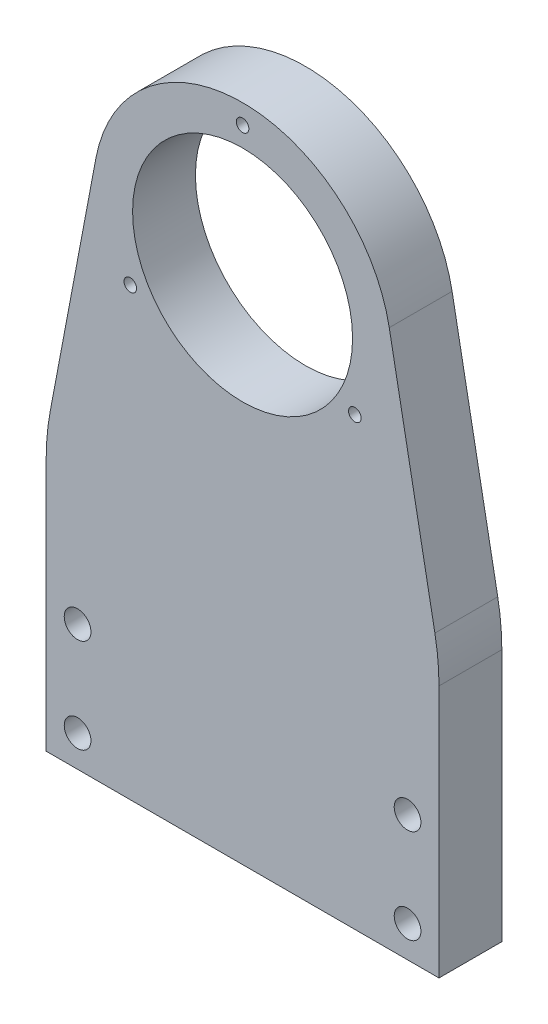
ISO-10303-21;
HEADER;
FILE_DESCRIPTION(('STEP AP214'),'2;1');
FILE_NAME('part.step','',(''),(''),'','','');
FILE_SCHEMA(('AUTOMOTIVE_DESIGN { 1 0 10303 214 1 1 1 1 }'));
ENDSEC;
DATA;
#1=APPLICATION_CONTEXT('core data for automotive mechanical design processes');
#2=APPLICATION_PROTOCOL_DEFINITION('international standard','automotive_design',2000,#1);
#3=PRODUCT_CONTEXT('',#1,'mechanical');
#4=PRODUCT('Part','Part','',(#3));
#5=PRODUCT_RELATED_PRODUCT_CATEGORY('part','',(#4));
#6=PRODUCT_DEFINITION_FORMATION('','',#4);
#7=PRODUCT_DEFINITION_CONTEXT('part definition',#1,'design');
#8=PRODUCT_DEFINITION('design','',#6,#7);
#9=PRODUCT_DEFINITION_SHAPE('','',#8);
#10=(LENGTH_UNIT() NAMED_UNIT(*) SI_UNIT(.MILLI.,.METRE.));
#11=(NAMED_UNIT(*) PLANE_ANGLE_UNIT() SI_UNIT($,.RADIAN.));
#12=(NAMED_UNIT(*) SI_UNIT($,.STERADIAN.) SOLID_ANGLE_UNIT());
#13=UNCERTAINTY_MEASURE_WITH_UNIT(LENGTH_MEASURE(1.E-05),#10,'distance_accuracy_value','');
#14=(GEOMETRIC_REPRESENTATION_CONTEXT(3) GLOBAL_UNCERTAINTY_ASSIGNED_CONTEXT((#13)) GLOBAL_UNIT_ASSIGNED_CONTEXT((#10,
#11,#12)) REPRESENTATION_CONTEXT('',''));
#15=CARTESIAN_POINT('',(0.,0.,0.));
#16=DIRECTION('',(0.,0.,1.));
#17=DIRECTION('',(1.,0.,0.));
#18=AXIS2_PLACEMENT_3D('',#15,#16,#17);
#19=CARTESIAN_POINT('',(0.,0.,0.));
#20=DIRECTION('',(0.,0.,1.));
#21=DIRECTION('',(1.,0.,0.));
#22=AXIS2_PLACEMENT_3D('',#19,#20,#21);
#23=PLANE('',#22);
#24=CARTESIAN_POINT('',(25.,81.5,0.));
#25=DIRECTION('',(0.,0.,-1.));
#26=DIRECTION('',(-1.,0.,0.));
#27=AXIS2_PLACEMENT_3D('',#24,#25,#26);
#28=CIRCLE('',#27,0.799999999999988);
#29=CARTESIAN_POINT('',(24.2,81.5,0.));
#30=VERTEX_POINT('',#29);
#31=EDGE_CURVE('E543',#30,#30,#28,.T.);
#32=ORIENTED_EDGE('',*,*,#31,.F.);
#33=EDGE_LOOP('',(#32));
#34=FACE_BOUND('',#33,.T.);
#35=CARTESIAN_POINT('',(39.2894191624432,56.75,0.));
#36=DIRECTION('',(0.,0.,-1.));
#37=DIRECTION('',(-1.,0.,0.));
#38=AXIS2_PLACEMENT_3D('',#35,#36,#37);
#39=CIRCLE('',#38,0.799999999999988);
#40=CARTESIAN_POINT('',(38.4894191624432,56.75,0.));
#41=VERTEX_POINT('',#40);
#42=EDGE_CURVE('E535',#41,#41,#39,.T.);
#43=ORIENTED_EDGE('',*,*,#42,.F.);
#44=EDGE_LOOP('',(#43));
#45=FACE_BOUND('',#44,.T.);
#46=CARTESIAN_POINT('',(10.7105808375568,56.75,0.));
#47=DIRECTION('',(0.,0.,-1.));
#48=DIRECTION('',(-1.,0.,0.));
#49=AXIS2_PLACEMENT_3D('',#46,#47,#48);
#50=CIRCLE('',#49,0.799999999999988);
#51=CARTESIAN_POINT('',(9.91058083755677,56.75,0.));
#52=VERTEX_POINT('',#51);
#53=EDGE_CURVE('E530',#52,#52,#50,.T.);
#54=ORIENTED_EDGE('',*,*,#53,.F.);
#55=EDGE_LOOP('',(#54));
#56=FACE_BOUND('',#55,.T.);
#57=CARTESIAN_POINT('',(46.,16.,0.));
#58=DIRECTION('',(0.,0.,-1.));
#59=DIRECTION('',(-1.,0.,0.));
#60=AXIS2_PLACEMENT_3D('',#57,#58,#59);
#61=CIRCLE('',#60,3.36);
#62=CARTESIAN_POINT('',(42.64,16.,0.));
#63=VERTEX_POINT('',#62);
#64=EDGE_CURVE('E162',#63,#63,#61,.T.);
#65=ORIENTED_EDGE('',*,*,#64,.F.);
#66=EDGE_LOOP('',(#65));
#67=FACE_BOUND('',#66,.T.);
#68=CARTESIAN_POINT('',(25.,65.,0.));
#69=DIRECTION('',(0.,0.,-1.));
#70=DIRECTION('',(-1.,0.,0.));
#71=AXIS2_PLACEMENT_3D('',#68,#69,#70);
#72=CIRCLE('',#71,14.);
#73=CARTESIAN_POINT('',(11.,65.,0.));
#74=VERTEX_POINT('',#73);
#75=EDGE_CURVE('E181',#74,#74,#72,.T.);
#76=ORIENTED_EDGE('',*,*,#75,.F.);
#77=EDGE_LOOP('',(#76));
#78=FACE_BOUND('',#77,.T.);
#79=DIRECTION('',(0.,1.,0.));
#80=VECTOR('',#79,1.);
#81=CARTESIAN_POINT('',(0.,0.,0.));
#82=LINE('',#81,#80);
#83=CARTESIAN_POINT('',(0.,0.,0.));
#84=VERTEX_POINT('',#83);
#85=CARTESIAN_POINT('',(0.,32.1926516692291,0.));
#86=VERTEX_POINT('',#85);
#87=EDGE_CURVE('E209',#84,#86,#82,.T.);
#88=ORIENTED_EDGE('',*,*,#87,.T.);
#89=CARTESIAN_POINT('',(30.,32.1926516692291,0.));
#90=DIRECTION('',(0.,0.,1.));
#91=DIRECTION('',(1.,0.,0.));
#92=AXIS2_PLACEMENT_3D('',#89,#90,#91);
#93=CIRCLE('',#92,30.);
#94=CARTESIAN_POINT('',(0.520852592381924,37.7586078422442,0.));
#95=VERTEX_POINT('',#94);
#96=EDGE_CURVE('E230',#86,#95,#93,.F.);
#97=ORIENTED_EDGE('',*,*,#96,.T.);
#98=DIRECTION('',(0.185531872433835,0.982638246920603,0.));
#99=VECTOR('',#98,1.);
#100=CARTESIAN_POINT('',(-6.38087498566983,1.20477264910817,0.));
#101=LINE('',#100,#99);
#102=CARTESIAN_POINT('',(6.32987330850855,68.5251055762429,0.));
#103=VERTEX_POINT('',#102);
#104=EDGE_CURVE('E207',#95,#103,#101,.T.);
#105=ORIENTED_EDGE('',*,*,#104,.T.);
#106=CARTESIAN_POINT('',(25.,65.,0.));
#107=DIRECTION('',(0.,0.,1.));
#108=DIRECTION('',(1.,0.,0.));
#109=AXIS2_PLACEMENT_3D('',#106,#107,#108);
#110=CIRCLE('',#109,19.);
#111=CARTESIAN_POINT('',(43.6701266914915,68.5251055762429,0.));
#112=VERTEX_POINT('',#111);
#113=EDGE_CURVE('E204',#112,#103,#110,.T.);
#114=ORIENTED_EDGE('',*,*,#113,.F.);
#115=DIRECTION('',(-0.185531872433835,0.982638246920603,0.));
#116=VECTOR('',#115,1.);
#117=CARTESIAN_POINT('',(54.6597712012296,10.3203083429222,0.));
#118=LINE('',#117,#116);
#119=CARTESIAN_POINT('',(49.4791474076181,37.7586078422442,0.));
#120=VERTEX_POINT('',#119);
#121=EDGE_CURVE('E184',#120,#112,#118,.T.);
#122=ORIENTED_EDGE('',*,*,#121,.F.);
#123=CARTESIAN_POINT('',(20.,32.1926516692291,0.));
#124=DIRECTION('',(0.,0.,1.));
#125=DIRECTION('',(1.,0.,0.));
#126=AXIS2_PLACEMENT_3D('',#123,#124,#125);
#127=CIRCLE('',#126,30.);
#128=CARTESIAN_POINT('',(50.,32.1926516692291,0.));
#129=VERTEX_POINT('',#128);
#130=EDGE_CURVE('E228',#120,#129,#127,.F.);
#131=ORIENTED_EDGE('',*,*,#130,.T.);
#132=DIRECTION('',(0.,1.,0.));
#133=VECTOR('',#132,1.);
#134=CARTESIAN_POINT('',(50.,0.,0.));
#135=LINE('',#134,#133);
#136=CARTESIAN_POINT('',(50.,0.,0.));
#137=VERTEX_POINT('',#136);
#138=EDGE_CURVE('E190',#137,#129,#135,.T.);
#139=ORIENTED_EDGE('',*,*,#138,.F.);
#140=DIRECTION('',(1.,0.,0.));
#141=VECTOR('',#140,1.);
#142=CARTESIAN_POINT('',(0.,0.,0.));
#143=LINE('',#142,#141);
#144=EDGE_CURVE('E212',#84,#137,#143,.T.);
#145=ORIENTED_EDGE('',*,*,#144,.F.);
#146=EDGE_LOOP('',(#88,#97,#105,#114,#122,#131,#139,#145));
#147=FACE_BOUND('',#146,.T.);
#148=CARTESIAN_POINT('',(46.,4.,0.));
#149=DIRECTION('',(0.,0.,-1.));
#150=DIRECTION('',(-1.,0.,0.));
#151=AXIS2_PLACEMENT_3D('',#148,#149,#150);
#152=CIRCLE('',#151,3.36);
#153=CARTESIAN_POINT('',(42.64,4.,0.));
#154=VERTEX_POINT('',#153);
#155=EDGE_CURVE('E171',#154,#154,#152,.T.);
#156=ORIENTED_EDGE('',*,*,#155,.F.);
#157=EDGE_LOOP('',(#156));
#158=FACE_BOUND('',#157,.T.);
#159=CARTESIAN_POINT('',(4.,4.,0.));
#160=DIRECTION('',(0.,0.,-1.));
#161=DIRECTION('',(-1.,0.,0.));
#162=AXIS2_PLACEMENT_3D('',#159,#160,#161);
#163=CIRCLE('',#162,3.36);
#164=CARTESIAN_POINT('',(0.639999999999998,4.,0.));
#165=VERTEX_POINT('',#164);
#166=EDGE_CURVE('E153',#165,#165,#163,.T.);
#167=ORIENTED_EDGE('',*,*,#166,.F.);
#168=EDGE_LOOP('',(#167));
#169=FACE_BOUND('',#168,.T.);
#170=CARTESIAN_POINT('',(4.,16.,0.));
#171=DIRECTION('',(0.,0.,-1.));
#172=DIRECTION('',(-1.,0.,0.));
#173=AXIS2_PLACEMENT_3D('',#170,#171,#172);
#174=CIRCLE('',#173,3.36);
#175=CARTESIAN_POINT('',(0.639999999999999,16.,0.));
#176=VERTEX_POINT('',#175);
#177=EDGE_CURVE('E144',#176,#176,#174,.T.);
#178=ORIENTED_EDGE('',*,*,#177,.F.);
#179=EDGE_LOOP('',(#178));
#180=FACE_BOUND('',#179,.T.);
#181=ADVANCED_FACE('F52',(#34,#45,#56,#67,#78,#147,#158,#169,#180),#23,.F.);
#182=CARTESIAN_POINT('',(54.6597712012296,10.3203083429222,8.));
#183=DIRECTION('',(-0.982638246920603,-0.185531872433835,0.));
#184=DIRECTION('',(0.185531872433835,-0.982638246920603,0.));
#185=AXIS2_PLACEMENT_3D('',#182,#183,#184);
#186=PLANE('',#185);
#187=DIRECTION('',(-0.185531872433835,0.982638246920603,0.));
#188=VECTOR('',#187,1.);
#189=CARTESIAN_POINT('',(54.6597712012296,10.3203083429222,8.));
#190=LINE('',#189,#188);
#191=CARTESIAN_POINT('',(49.4791474076181,37.7586078422442,8.));
#192=VERTEX_POINT('',#191);
#193=CARTESIAN_POINT('',(43.6701266914915,68.5251055762429,8.));
#194=VERTEX_POINT('',#193);
#195=EDGE_CURVE('E187',#192,#194,#190,.T.);
#196=ORIENTED_EDGE('',*,*,#195,.F.);
#197=DIRECTION('',(0.,0.,-1.));
#198=VECTOR('',#197,1.);
#199=CARTESIAN_POINT('',(49.4791474076181,37.7586078422442,8.));
#200=LINE('',#199,#198);
#201=EDGE_CURVE('E60',#192,#120,#200,.T.);
#202=ORIENTED_EDGE('',*,*,#201,.T.);
#203=ORIENTED_EDGE('',*,*,#121,.T.);
#204=DIRECTION('',(0.,0.,-1.));
#205=VECTOR('',#204,1.);
#206=CARTESIAN_POINT('',(43.6701266914915,68.5251055762429,8.));
#207=LINE('',#206,#205);
#208=EDGE_CURVE('E222',#194,#112,#207,.T.);
#209=ORIENTED_EDGE('',*,*,#208,.F.);
#210=EDGE_LOOP('',(#196,#202,#203,#209));
#211=FACE_BOUND('',#210,.T.);
#212=ADVANCED_FACE('F240',(#211),#186,.F.);
#213=CARTESIAN_POINT('',(25.,65.,8.));
#214=DIRECTION('',(0.,0.,-1.));
#215=DIRECTION('',(-1.,0.,0.));
#216=AXIS2_PLACEMENT_3D('',#213,#214,#215);
#217=CYLINDRICAL_SURFACE('',#216,19.);
#218=ORIENTED_EDGE('',*,*,#113,.T.);
#219=DIRECTION('',(0.,0.,-1.));
#220=VECTOR('',#219,1.);
#221=CARTESIAN_POINT('',(6.32987330850855,68.5251055762429,8.));
#222=LINE('',#221,#220);
#223=CARTESIAN_POINT('',(6.32987330850855,68.5251055762429,8.));
#224=VERTEX_POINT('',#223);
#225=EDGE_CURVE('E219',#224,#103,#222,.T.);
#226=ORIENTED_EDGE('',*,*,#225,.F.);
#227=CARTESIAN_POINT('',(25.,65.,8.));
#228=DIRECTION('',(0.,0.,1.));
#229=DIRECTION('',(1.,0.,0.));
#230=AXIS2_PLACEMENT_3D('',#227,#228,#229);
#231=CIRCLE('',#230,19.);
#232=EDGE_CURVE('E189',#194,#224,#231,.T.);
#233=ORIENTED_EDGE('',*,*,#232,.F.);
#234=ORIENTED_EDGE('',*,*,#208,.T.);
#235=EDGE_LOOP('',(#218,#226,#233,#234));
#236=FACE_BOUND('',#235,.T.);
#237=ADVANCED_FACE('F251',(#236),#217,.T.);
#238=CARTESIAN_POINT('',(-6.38087498566983,1.20477264910817,8.));
#239=DIRECTION('',(-0.982638246920603,0.185531872433835,0.));
#240=DIRECTION('',(-0.185531872433835,-0.982638246920603,0.));
#241=AXIS2_PLACEMENT_3D('',#238,#239,#240);
#242=PLANE('',#241);
#243=ORIENTED_EDGE('',*,*,#104,.F.);
#244=DIRECTION('',(0.,0.,-1.));
#245=VECTOR('',#244,1.);
#246=CARTESIAN_POINT('',(0.520852592381923,37.7586078422442,8.));
#247=LINE('',#246,#245);
#248=CARTESIAN_POINT('',(0.520852592381924,37.7586078422442,8.));
#249=VERTEX_POINT('',#248);
#250=EDGE_CURVE('E232',#95,#249,#247,.F.);
#251=ORIENTED_EDGE('',*,*,#250,.T.);
#252=DIRECTION('',(0.185531872433835,0.982638246920603,0.));
#253=VECTOR('',#252,1.);
#254=CARTESIAN_POINT('',(-6.38087498566983,1.20477264910817,8.));
#255=LINE('',#254,#253);
#256=EDGE_CURVE('E193',#249,#224,#255,.T.);
#257=ORIENTED_EDGE('',*,*,#256,.T.);
#258=ORIENTED_EDGE('',*,*,#225,.T.);
#259=EDGE_LOOP('',(#243,#251,#257,#258));
#260=FACE_BOUND('',#259,.T.);
#261=ADVANCED_FACE('F297',(#260),#242,.T.);
#262=CARTESIAN_POINT('',(0.,0.,8.));
#263=DIRECTION('',(-1.,0.,0.));
#264=DIRECTION('',(0.,0.,1.));
#265=AXIS2_PLACEMENT_3D('',#262,#263,#264);
#266=PLANE('',#265);
#267=DIRECTION('',(0.,1.,0.));
#268=VECTOR('',#267,1.);
#269=CARTESIAN_POINT('',(0.,0.,8.));
#270=LINE('',#269,#268);
#271=CARTESIAN_POINT('',(0.,0.,8.));
#272=VERTEX_POINT('',#271);
#273=CARTESIAN_POINT('',(0.,32.1926516692291,8.));
#274=VERTEX_POINT('',#273);
#275=EDGE_CURVE('E195',#272,#274,#270,.T.);
#276=ORIENTED_EDGE('',*,*,#275,.T.);
#277=DIRECTION('',(0.,0.,-1.));
#278=VECTOR('',#277,1.);
#279=CARTESIAN_POINT('',(0.,32.1926516692291,8.));
#280=LINE('',#279,#278);
#281=EDGE_CURVE('E225',#274,#86,#280,.T.);
#282=ORIENTED_EDGE('',*,*,#281,.T.);
#283=ORIENTED_EDGE('',*,*,#87,.F.);
#284=DIRECTION('',(0.,0.,-1.));
#285=VECTOR('',#284,1.);
#286=CARTESIAN_POINT('',(0.,0.,8.));
#287=LINE('',#286,#285);
#288=EDGE_CURVE('E217',#272,#84,#287,.T.);
#289=ORIENTED_EDGE('',*,*,#288,.F.);
#290=EDGE_LOOP('',(#276,#282,#283,#289));
#291=FACE_BOUND('',#290,.T.);
#292=ADVANCED_FACE('F263',(#291),#266,.T.);
#293=CARTESIAN_POINT('',(0.,0.,8.));
#294=DIRECTION('',(0.,1.,0.));
#295=DIRECTION('',(0.,0.,1.));
#296=AXIS2_PLACEMENT_3D('',#293,#294,#295);
#297=PLANE('',#296);
#298=CARTESIAN_POINT('',(38.,0.,4.));
#299=DIRECTION('',(0.,-1.,0.));
#300=DIRECTION('',(0.,0.,-1.));
#301=AXIS2_PLACEMENT_3D('',#298,#299,#300);
#302=CIRCLE('',#301,1.24999999999999);
#303=CARTESIAN_POINT('',(38.,0.,2.75000000000001));
#304=VERTEX_POINT('',#303);
#305=EDGE_CURVE('E132',#304,#304,#302,.T.);
#306=ORIENTED_EDGE('',*,*,#305,.F.);
#307=EDGE_LOOP('',(#306));
#308=FACE_BOUND('',#307,.T.);
#309=CARTESIAN_POINT('',(12.,0.,4.));
#310=DIRECTION('',(0.,-1.,0.));
#311=DIRECTION('',(0.,0.,-1.));
#312=AXIS2_PLACEMENT_3D('',#309,#310,#311);
#313=CIRCLE('',#312,1.24999999999999);
#314=CARTESIAN_POINT('',(12.,0.,2.75000000000001));
#315=VERTEX_POINT('',#314);
#316=EDGE_CURVE('E131',#315,#315,#313,.T.);
#317=ORIENTED_EDGE('',*,*,#316,.F.);
#318=EDGE_LOOP('',(#317));
#319=FACE_BOUND('',#318,.T.);
#320=ORIENTED_EDGE('',*,*,#144,.T.);
#321=DIRECTION('',(0.,0.,-1.));
#322=VECTOR('',#321,1.);
#323=CARTESIAN_POINT('',(50.,0.,8.));
#324=LINE('',#323,#322);
#325=CARTESIAN_POINT('',(50.,0.,8.));
#326=VERTEX_POINT('',#325);
#327=EDGE_CURVE('E202',#326,#137,#324,.T.);
#328=ORIENTED_EDGE('',*,*,#327,.F.);
#329=DIRECTION('',(1.,0.,0.));
#330=VECTOR('',#329,1.);
#331=CARTESIAN_POINT('',(0.,0.,8.));
#332=LINE('',#331,#330);
#333=EDGE_CURVE('E198',#272,#326,#332,.T.);
#334=ORIENTED_EDGE('',*,*,#333,.F.);
#335=ORIENTED_EDGE('',*,*,#288,.T.);
#336=EDGE_LOOP('',(#320,#328,#334,#335));
#337=FACE_BOUND('',#336,.T.);
#338=ADVANCED_FACE('F267',(#308,#319,#337),#297,.F.);
#339=CARTESIAN_POINT('',(50.,0.,8.));
#340=DIRECTION('',(-1.,0.,0.));
#341=DIRECTION('',(0.,0.,1.));
#342=AXIS2_PLACEMENT_3D('',#339,#340,#341);
#343=PLANE('',#342);
#344=ORIENTED_EDGE('',*,*,#138,.T.);
#345=DIRECTION('',(0.,0.,-1.));
#346=VECTOR('',#345,1.);
#347=CARTESIAN_POINT('',(50.,32.1926516692291,8.));
#348=LINE('',#347,#346);
#349=CARTESIAN_POINT('',(50.,32.1926516692291,8.));
#350=VERTEX_POINT('',#349);
#351=EDGE_CURVE('E13',#129,#350,#348,.F.);
#352=ORIENTED_EDGE('',*,*,#351,.T.);
#353=DIRECTION('',(0.,1.,0.));
#354=VECTOR('',#353,1.);
#355=CARTESIAN_POINT('',(50.,0.,8.));
#356=LINE('',#355,#354);
#357=EDGE_CURVE('E200',#326,#350,#356,.T.);
#358=ORIENTED_EDGE('',*,*,#357,.F.);
#359=ORIENTED_EDGE('',*,*,#327,.T.);
#360=EDGE_LOOP('',(#344,#352,#358,#359));
#361=FACE_BOUND('',#360,.T.);
#362=ADVANCED_FACE('F269',(#361),#343,.F.);
#363=CARTESIAN_POINT('',(0.,0.,8.));
#364=DIRECTION('',(0.,0.,1.));
#365=DIRECTION('',(1.,0.,0.));
#366=AXIS2_PLACEMENT_3D('',#363,#364,#365);
#367=PLANE('',#366);
#368=CARTESIAN_POINT('',(25.,81.5,8.));
#369=DIRECTION('',(0.,0.,-1.));
#370=DIRECTION('',(-1.,0.,0.));
#371=AXIS2_PLACEMENT_3D('',#368,#369,#370);
#372=CIRCLE('',#371,0.799999999999999);
#373=CARTESIAN_POINT('',(24.2,81.5,8.));
#374=VERTEX_POINT('',#373);
#375=EDGE_CURVE('E540',#374,#374,#372,.T.);
#376=ORIENTED_EDGE('',*,*,#375,.T.);
#377=EDGE_LOOP('',(#376));
#378=FACE_BOUND('',#377,.T.);
#379=CARTESIAN_POINT('',(39.2894191624432,56.75,8.));
#380=DIRECTION('',(0.,0.,-1.));
#381=DIRECTION('',(-1.,0.,0.));
#382=AXIS2_PLACEMENT_3D('',#379,#380,#381);
#383=CIRCLE('',#382,0.799999999999995);
#384=CARTESIAN_POINT('',(38.4894191624432,56.75,8.));
#385=VERTEX_POINT('',#384);
#386=EDGE_CURVE('E532',#385,#385,#383,.T.);
#387=ORIENTED_EDGE('',*,*,#386,.T.);
#388=EDGE_LOOP('',(#387));
#389=FACE_BOUND('',#388,.T.);
#390=CARTESIAN_POINT('',(10.7105808375568,56.75,8.));
#391=DIRECTION('',(0.,0.,-1.));
#392=DIRECTION('',(-1.,0.,0.));
#393=AXIS2_PLACEMENT_3D('',#390,#391,#392);
#394=CIRCLE('',#393,0.799999999999999);
#395=CARTESIAN_POINT('',(9.91058083755676,56.75,8.));
#396=VERTEX_POINT('',#395);
#397=EDGE_CURVE('E138',#396,#396,#394,.T.);
#398=ORIENTED_EDGE('',*,*,#397,.T.);
#399=EDGE_LOOP('',(#398));
#400=FACE_BOUND('',#399,.T.);
#401=CARTESIAN_POINT('',(4.,16.,8.));
#402=DIRECTION('',(0.,0.,1.));
#403=DIRECTION('',(1.,0.,0.));
#404=AXIS2_PLACEMENT_3D('',#401,#402,#403);
#405=CIRCLE('',#404,1.7);
#406=CARTESIAN_POINT('',(5.7,16.,8.));
#407=VERTEX_POINT('',#406);
#408=EDGE_CURVE('E150',#407,#407,#405,.T.);
#409=ORIENTED_EDGE('',*,*,#408,.F.);
#410=EDGE_LOOP('',(#409));
#411=FACE_BOUND('',#410,.T.);
#412=CARTESIAN_POINT('',(4.,4.,8.));
#413=DIRECTION('',(0.,0.,1.));
#414=DIRECTION('',(1.,0.,0.));
#415=AXIS2_PLACEMENT_3D('',#412,#413,#414);
#416=CIRCLE('',#415,1.7);
#417=CARTESIAN_POINT('',(5.7,4.,8.));
#418=VERTEX_POINT('',#417);
#419=EDGE_CURVE('E159',#418,#418,#416,.T.);
#420=ORIENTED_EDGE('',*,*,#419,.F.);
#421=EDGE_LOOP('',(#420));
#422=FACE_BOUND('',#421,.T.);
#423=CARTESIAN_POINT('',(46.,16.,8.));
#424=DIRECTION('',(0.,0.,1.));
#425=DIRECTION('',(1.,0.,0.));
#426=AXIS2_PLACEMENT_3D('',#423,#424,#425);
#427=CIRCLE('',#426,1.7);
#428=CARTESIAN_POINT('',(47.7,16.,8.));
#429=VERTEX_POINT('',#428);
#430=EDGE_CURVE('E168',#429,#429,#427,.T.);
#431=ORIENTED_EDGE('',*,*,#430,.F.);
#432=EDGE_LOOP('',(#431));
#433=FACE_BOUND('',#432,.T.);
#434=CARTESIAN_POINT('',(46.,4.,8.));
#435=DIRECTION('',(0.,0.,1.));
#436=DIRECTION('',(1.,0.,0.));
#437=AXIS2_PLACEMENT_3D('',#434,#435,#436);
#438=CIRCLE('',#437,1.7);
#439=CARTESIAN_POINT('',(47.7,4.,8.));
#440=VERTEX_POINT('',#439);
#441=EDGE_CURVE('E177',#440,#440,#438,.T.);
#442=ORIENTED_EDGE('',*,*,#441,.F.);
#443=EDGE_LOOP('',(#442));
#444=FACE_BOUND('',#443,.T.);
#445=CARTESIAN_POINT('',(25.,65.,8.));
#446=DIRECTION('',(0.,0.,1.));
#447=DIRECTION('',(1.,0.,0.));
#448=AXIS2_PLACEMENT_3D('',#445,#446,#447);
#449=CIRCLE('',#448,14.);
#450=CARTESIAN_POINT('',(39.,65.,8.));
#451=VERTEX_POINT('',#450);
#452=EDGE_CURVE('E180',#451,#451,#449,.F.);
#453=ORIENTED_EDGE('',*,*,#452,.T.);
#454=EDGE_LOOP('',(#453));
#455=FACE_BOUND('',#454,.T.);
#456=ORIENTED_EDGE('',*,*,#256,.F.);
#457=CARTESIAN_POINT('',(30.,32.1926516692291,8.));
#458=DIRECTION('',(0.,0.,1.));
#459=DIRECTION('',(1.,0.,0.));
#460=AXIS2_PLACEMENT_3D('',#457,#458,#459);
#461=CIRCLE('',#460,30.);
#462=EDGE_CURVE('E235',#249,#274,#461,.T.);
#463=ORIENTED_EDGE('',*,*,#462,.T.);
#464=ORIENTED_EDGE('',*,*,#275,.F.);
#465=ORIENTED_EDGE('',*,*,#333,.T.);
#466=ORIENTED_EDGE('',*,*,#357,.T.);
#467=CARTESIAN_POINT('',(20.,32.1926516692291,8.));
#468=DIRECTION('',(0.,0.,1.));
#469=DIRECTION('',(1.,0.,0.));
#470=AXIS2_PLACEMENT_3D('',#467,#468,#469);
#471=CIRCLE('',#470,30.);
#472=EDGE_CURVE('E72',#350,#192,#471,.T.);
#473=ORIENTED_EDGE('',*,*,#472,.T.);
#474=ORIENTED_EDGE('',*,*,#195,.T.);
#475=ORIENTED_EDGE('',*,*,#232,.T.);
#476=EDGE_LOOP('',(#456,#463,#464,#465,#466,#473,#474,#475));
#477=FACE_BOUND('',#476,.T.);
#478=ADVANCED_FACE('F253',(#378,#389,#400,#411,#422,#433,#444,#455,#477),#367,.T.);
#479=CARTESIAN_POINT('',(30.,32.1926516692291,8.));
#480=DIRECTION('',(0.,0.,-1.));
#481=DIRECTION('',(-1.,0.,0.));
#482=AXIS2_PLACEMENT_3D('',#479,#480,#481);
#483=CYLINDRICAL_SURFACE('',#482,30.);
#484=ORIENTED_EDGE('',*,*,#462,.F.);
#485=ORIENTED_EDGE('',*,*,#250,.F.);
#486=ORIENTED_EDGE('',*,*,#96,.F.);
#487=ORIENTED_EDGE('',*,*,#281,.F.);
#488=EDGE_LOOP('',(#484,#485,#486,#487));
#489=FACE_BOUND('',#488,.T.);
#490=ADVANCED_FACE('F260',(#489),#483,.T.);
#491=CARTESIAN_POINT('',(20.,32.1926516692291,8.));
#492=DIRECTION('',(0.,0.,-1.));
#493=DIRECTION('',(-1.,0.,0.));
#494=AXIS2_PLACEMENT_3D('',#491,#492,#493);
#495=CYLINDRICAL_SURFACE('',#494,30.);
#496=ORIENTED_EDGE('',*,*,#472,.F.);
#497=ORIENTED_EDGE('',*,*,#351,.F.);
#498=ORIENTED_EDGE('',*,*,#130,.F.);
#499=ORIENTED_EDGE('',*,*,#201,.F.);
#500=EDGE_LOOP('',(#496,#497,#498,#499));
#501=FACE_BOUND('',#500,.T.);
#502=ADVANCED_FACE('F54',(#501),#495,.T.);
#503=CARTESIAN_POINT('',(25.,65.,8.001));
#504=DIRECTION('',(0.,0.,-1.));
#505=DIRECTION('',(-1.,0.,0.));
#506=AXIS2_PLACEMENT_3D('',#503,#504,#505);
#507=CYLINDRICAL_SURFACE('',#506,14.);
#508=ORIENTED_EDGE('',*,*,#452,.F.);
#509=EDGE_LOOP('',(#508));
#510=FACE_BOUND('',#509,.T.);
#511=ORIENTED_EDGE('',*,*,#75,.T.);
#512=EDGE_LOOP('',(#511));
#513=FACE_BOUND('',#512,.T.);
#514=ADVANCED_FACE('F271',(#510,#513),#507,.F.);
#515=CARTESIAN_POINT('',(46.,4.,0.));
#516=DIRECTION('',(0.,0.,-1.));
#517=DIRECTION('',(-1.,0.,0.));
#518=AXIS2_PLACEMENT_3D('',#515,#516,#517);
#519=CYLINDRICAL_SURFACE('',#518,1.7);
#520=CARTESIAN_POINT('',(46.,4.,1.66));
#521=DIRECTION('',(0.,0.,-1.));
#522=DIRECTION('',(-1.,0.,0.));
#523=AXIS2_PLACEMENT_3D('',#520,#521,#522);
#524=CIRCLE('',#523,1.7);
#525=CARTESIAN_POINT('',(44.3,4.,1.66));
#526=VERTEX_POINT('',#525);
#527=EDGE_CURVE('E174',#526,#526,#524,.T.);
#528=ORIENTED_EDGE('',*,*,#527,.T.);
#529=EDGE_LOOP('',(#528));
#530=FACE_BOUND('',#529,.T.);
#531=ORIENTED_EDGE('',*,*,#441,.T.);
#532=EDGE_LOOP('',(#531));
#533=FACE_BOUND('',#532,.T.);
#534=ADVANCED_FACE('F276',(#530,#533),#519,.F.);
#535=CARTESIAN_POINT('',(46.,4.,0.));
#536=DIRECTION('',(0.,0.,-1.));
#537=DIRECTION('',(-1.,0.,0.));
#538=AXIS2_PLACEMENT_3D('',#535,#536,#537);
#539=CONICAL_SURFACE('',#538,3.36,0.785398163397449);
#540=ORIENTED_EDGE('',*,*,#527,.F.);
#541=EDGE_LOOP('',(#540));
#542=FACE_BOUND('',#541,.T.);
#543=ORIENTED_EDGE('',*,*,#155,.T.);
#544=EDGE_LOOP('',(#543));
#545=FACE_BOUND('',#544,.T.);
#546=ADVANCED_FACE('F354',(#542,#545),#539,.F.);
#547=CARTESIAN_POINT('',(46.,16.,0.));
#548=DIRECTION('',(0.,0.,-1.));
#549=DIRECTION('',(-1.,0.,0.));
#550=AXIS2_PLACEMENT_3D('',#547,#548,#549);
#551=CYLINDRICAL_SURFACE('',#550,1.7);
#552=CARTESIAN_POINT('',(46.,16.,1.66));
#553=DIRECTION('',(0.,0.,-1.));
#554=DIRECTION('',(-1.,0.,0.));
#555=AXIS2_PLACEMENT_3D('',#552,#553,#554);
#556=CIRCLE('',#555,1.7);
#557=CARTESIAN_POINT('',(44.3,16.,1.66));
#558=VERTEX_POINT('',#557);
#559=EDGE_CURVE('E165',#558,#558,#556,.T.);
#560=ORIENTED_EDGE('',*,*,#559,.T.);
#561=EDGE_LOOP('',(#560));
#562=FACE_BOUND('',#561,.T.);
#563=ORIENTED_EDGE('',*,*,#430,.T.);
#564=EDGE_LOOP('',(#563));
#565=FACE_BOUND('',#564,.T.);
#566=ADVANCED_FACE('F365',(#562,#565),#551,.F.);
#567=CARTESIAN_POINT('',(46.,16.,0.));
#568=DIRECTION('',(0.,0.,-1.));
#569=DIRECTION('',(-1.,0.,0.));
#570=AXIS2_PLACEMENT_3D('',#567,#568,#569);
#571=CONICAL_SURFACE('',#570,3.36,0.785398163397449);
#572=ORIENTED_EDGE('',*,*,#559,.F.);
#573=EDGE_LOOP('',(#572));
#574=FACE_BOUND('',#573,.T.);
#575=ORIENTED_EDGE('',*,*,#64,.T.);
#576=EDGE_LOOP('',(#575));
#577=FACE_BOUND('',#576,.T.);
#578=ADVANCED_FACE('F375',(#574,#577),#571,.F.);
#579=CARTESIAN_POINT('',(4.,4.,0.));
#580=DIRECTION('',(0.,0.,-1.));
#581=DIRECTION('',(-1.,0.,0.));
#582=AXIS2_PLACEMENT_3D('',#579,#580,#581);
#583=CYLINDRICAL_SURFACE('',#582,1.7);
#584=CARTESIAN_POINT('',(4.,4.,1.66));
#585=DIRECTION('',(0.,0.,-1.));
#586=DIRECTION('',(-1.,0.,0.));
#587=AXIS2_PLACEMENT_3D('',#584,#585,#586);
#588=CIRCLE('',#587,1.7);
#589=CARTESIAN_POINT('',(2.3,4.,1.66));
#590=VERTEX_POINT('',#589);
#591=EDGE_CURVE('E156',#590,#590,#588,.T.);
#592=ORIENTED_EDGE('',*,*,#591,.T.);
#593=EDGE_LOOP('',(#592));
#594=FACE_BOUND('',#593,.T.);
#595=ORIENTED_EDGE('',*,*,#419,.T.);
#596=EDGE_LOOP('',(#595));
#597=FACE_BOUND('',#596,.T.);
#598=ADVANCED_FACE('F385',(#594,#597),#583,.F.);
#599=CARTESIAN_POINT('',(4.,4.,0.));
#600=DIRECTION('',(0.,0.,-1.));
#601=DIRECTION('',(-1.,0.,0.));
#602=AXIS2_PLACEMENT_3D('',#599,#600,#601);
#603=CONICAL_SURFACE('',#602,3.36,0.785398163397449);
#604=ORIENTED_EDGE('',*,*,#591,.F.);
#605=EDGE_LOOP('',(#604));
#606=FACE_BOUND('',#605,.T.);
#607=ORIENTED_EDGE('',*,*,#166,.T.);
#608=EDGE_LOOP('',(#607));
#609=FACE_BOUND('',#608,.T.);
#610=ADVANCED_FACE('F395',(#606,#609),#603,.F.);
#611=CARTESIAN_POINT('',(4.,16.,0.));
#612=DIRECTION('',(0.,0.,-1.));
#613=DIRECTION('',(-1.,0.,0.));
#614=AXIS2_PLACEMENT_3D('',#611,#612,#613);
#615=CYLINDRICAL_SURFACE('',#614,1.7);
#616=CARTESIAN_POINT('',(4.,16.,1.66));
#617=DIRECTION('',(0.,0.,-1.));
#618=DIRECTION('',(-1.,0.,0.));
#619=AXIS2_PLACEMENT_3D('',#616,#617,#618);
#620=CIRCLE('',#619,1.7);
#621=CARTESIAN_POINT('',(2.3,16.,1.66));
#622=VERTEX_POINT('',#621);
#623=EDGE_CURVE('E147',#622,#622,#620,.T.);
#624=ORIENTED_EDGE('',*,*,#623,.T.);
#625=EDGE_LOOP('',(#624));
#626=FACE_BOUND('',#625,.T.);
#627=ORIENTED_EDGE('',*,*,#408,.T.);
#628=EDGE_LOOP('',(#627));
#629=FACE_BOUND('',#628,.T.);
#630=ADVANCED_FACE('F405',(#626,#629),#615,.F.);
#631=CARTESIAN_POINT('',(4.,16.,0.));
#632=DIRECTION('',(0.,0.,-1.));
#633=DIRECTION('',(-1.,0.,0.));
#634=AXIS2_PLACEMENT_3D('',#631,#632,#633);
#635=CONICAL_SURFACE('',#634,3.36,0.785398163397449);
#636=ORIENTED_EDGE('',*,*,#623,.F.);
#637=EDGE_LOOP('',(#636));
#638=FACE_BOUND('',#637,.T.);
#639=ORIENTED_EDGE('',*,*,#177,.T.);
#640=EDGE_LOOP('',(#639));
#641=FACE_BOUND('',#640,.T.);
#642=ADVANCED_FACE('F415',(#638,#641),#635,.F.);
#643=CARTESIAN_POINT('',(12.,8.49999999999999,4.));
#644=DIRECTION('',(0.,-1.,0.));
#645=DIRECTION('',(0.,0.,-1.));
#646=AXIS2_PLACEMENT_3D('',#643,#644,#645);
#647=CONICAL_SURFACE('',#646,1.24999999999999,1.02974425867665);
#648=CARTESIAN_POINT('',(12.,9.25107577378444,4.));
#649=VERTEX_POINT('',#648);
#650=VERTEX_LOOP('',#649);
#651=FACE_BOUND('',#650,.T.);
#652=CARTESIAN_POINT('',(12.,8.49999999999999,4.));
#653=DIRECTION('',(0.,-1.,0.));
#654=DIRECTION('',(0.,0.,-1.));
#655=AXIS2_PLACEMENT_3D('',#652,#653,#654);
#656=CIRCLE('',#655,1.24999999999999);
#657=CARTESIAN_POINT('',(12.,8.49999999999999,2.75000000000001));
#658=VERTEX_POINT('',#657);
#659=EDGE_CURVE('E135',#658,#658,#656,.T.);
#660=ORIENTED_EDGE('',*,*,#659,.T.);
#661=EDGE_LOOP('',(#660));
#662=FACE_BOUND('',#661,.T.);
#663=ADVANCED_FACE('F425',(#651,#662),#647,.F.);
#664=CARTESIAN_POINT('',(12.,0.,4.));
#665=DIRECTION('',(0.,-1.,0.));
#666=DIRECTION('',(0.,0.,-1.));
#667=AXIS2_PLACEMENT_3D('',#664,#665,#666);
#668=CYLINDRICAL_SURFACE('',#667,1.24999999999999);
#669=ORIENTED_EDGE('',*,*,#659,.F.);
#670=EDGE_LOOP('',(#669));
#671=FACE_BOUND('',#670,.T.);
#672=ORIENTED_EDGE('',*,*,#316,.T.);
#673=EDGE_LOOP('',(#672));
#674=FACE_BOUND('',#673,.T.);
#675=ADVANCED_FACE('F125',(#671,#674),#668,.F.);
#676=CARTESIAN_POINT('',(38.,8.49999999999999,4.));
#677=DIRECTION('',(0.,-1.,0.));
#678=DIRECTION('',(0.,0.,-1.));
#679=AXIS2_PLACEMENT_3D('',#676,#677,#678);
#680=CONICAL_SURFACE('',#679,1.24999999999999,1.02974425867665);
#681=CARTESIAN_POINT('',(38.,9.25107577378444,4.));
#682=VERTEX_POINT('',#681);
#683=VERTEX_LOOP('',#682);
#684=FACE_BOUND('',#683,.T.);
#685=CARTESIAN_POINT('',(38.,8.49999999999999,4.));
#686=DIRECTION('',(0.,-1.,0.));
#687=DIRECTION('',(0.,0.,-1.));
#688=AXIS2_PLACEMENT_3D('',#685,#686,#687);
#689=CIRCLE('',#688,1.24999999999999);
#690=CARTESIAN_POINT('',(38.,8.49999999999999,2.75000000000001));
#691=VERTEX_POINT('',#690);
#692=EDGE_CURVE('E129',#691,#691,#689,.T.);
#693=ORIENTED_EDGE('',*,*,#692,.T.);
#694=EDGE_LOOP('',(#693));
#695=FACE_BOUND('',#694,.T.);
#696=ADVANCED_FACE('F121',(#684,#695),#680,.F.);
#697=CARTESIAN_POINT('',(38.,0.,4.));
#698=DIRECTION('',(0.,-1.,0.));
#699=DIRECTION('',(0.,0.,-1.));
#700=AXIS2_PLACEMENT_3D('',#697,#698,#699);
#701=CYLINDRICAL_SURFACE('',#700,1.24999999999999);
#702=ORIENTED_EDGE('',*,*,#692,.F.);
#703=EDGE_LOOP('',(#702));
#704=FACE_BOUND('',#703,.T.);
#705=ORIENTED_EDGE('',*,*,#305,.T.);
#706=EDGE_LOOP('',(#705));
#707=FACE_BOUND('',#706,.T.);
#708=ADVANCED_FACE('F124',(#704,#707),#701,.F.);
#709=CARTESIAN_POINT('',(10.7105808375568,56.75,0.));
#710=DIRECTION('',(0.,0.,-1.));
#711=DIRECTION('',(-1.,0.,0.));
#712=AXIS2_PLACEMENT_3D('',#709,#710,#711);
#713=CYLINDRICAL_SURFACE('',#712,0.799999999999993);
#714=ORIENTED_EDGE('',*,*,#397,.F.);
#715=EDGE_LOOP('',(#714));
#716=FACE_BOUND('',#715,.T.);
#717=ORIENTED_EDGE('',*,*,#53,.T.);
#718=EDGE_LOOP('',(#717));
#719=FACE_BOUND('',#718,.T.);
#720=ADVANCED_FACE('F469',(#716,#719),#713,.F.);
#721=CARTESIAN_POINT('',(39.2894191624432,56.75,0.));
#722=DIRECTION('',(0.,0.,-1.));
#723=DIRECTION('',(-1.,0.,0.));
#724=AXIS2_PLACEMENT_3D('',#721,#722,#723);
#725=CYLINDRICAL_SURFACE('',#724,0.799999999999992);
#726=ORIENTED_EDGE('',*,*,#386,.F.);
#727=EDGE_LOOP('',(#726));
#728=FACE_BOUND('',#727,.T.);
#729=ORIENTED_EDGE('',*,*,#42,.T.);
#730=EDGE_LOOP('',(#729));
#731=FACE_BOUND('',#730,.T.);
#732=ADVANCED_FACE('F491',(#728,#731),#725,.F.);
#733=CARTESIAN_POINT('',(25.,81.5,0.));
#734=DIRECTION('',(0.,0.,-1.));
#735=DIRECTION('',(-1.,0.,0.));
#736=AXIS2_PLACEMENT_3D('',#733,#734,#735);
#737=CYLINDRICAL_SURFACE('',#736,0.799999999999993);
#738=ORIENTED_EDGE('',*,*,#375,.F.);
#739=EDGE_LOOP('',(#738));
#740=FACE_BOUND('',#739,.T.);
#741=ORIENTED_EDGE('',*,*,#31,.T.);
#742=EDGE_LOOP('',(#741));
#743=FACE_BOUND('',#742,.T.);
#744=ADVANCED_FACE('F495',(#740,#743),#737,.F.);
#745=CLOSED_SHELL('',(#181,#212,#237,#261,#292,#338,#362,#478,#490,#502,#514,#534,#546,#566,
#578,#598,#610,#630,#642,#663,#675,#696,#708,#720,#732,#744));
#746=MANIFOLD_SOLID_BREP('B2',#745);
#747=ADVANCED_BREP_SHAPE_REPRESENTATION('',(#18,#746),#14);
#748=SHAPE_DEFINITION_REPRESENTATION(#9,#747);
ENDSEC;
END-ISO-10303-21;
